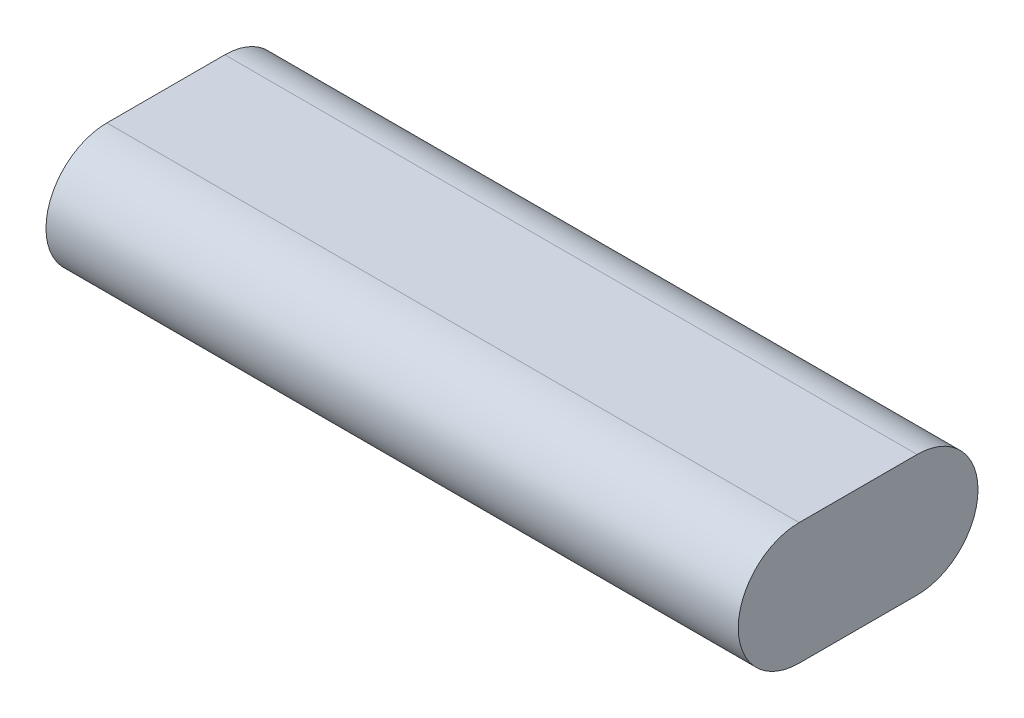
ISO-10303-21;
HEADER;
FILE_DESCRIPTION(('STEP AP214'),'2;1');
FILE_NAME('part.step','',(''),(''),'','','');
FILE_SCHEMA(('AUTOMOTIVE_DESIGN { 1 0 10303 214 1 1 1 1 }'));
ENDSEC;
DATA;
#1=APPLICATION_CONTEXT('core data for automotive mechanical design processes');
#2=APPLICATION_PROTOCOL_DEFINITION('international standard','automotive_design',2000,#1);
#3=PRODUCT_CONTEXT('',#1,'mechanical');
#4=PRODUCT('Part','Part','',(#3));
#5=PRODUCT_RELATED_PRODUCT_CATEGORY('part','',(#4));
#6=PRODUCT_DEFINITION_FORMATION('','',#4);
#7=PRODUCT_DEFINITION_CONTEXT('part definition',#1,'design');
#8=PRODUCT_DEFINITION('design','',#6,#7);
#9=PRODUCT_DEFINITION_SHAPE('','',#8);
#10=(LENGTH_UNIT() NAMED_UNIT(*) SI_UNIT(.MILLI.,.METRE.));
#11=(NAMED_UNIT(*) PLANE_ANGLE_UNIT() SI_UNIT($,.RADIAN.));
#12=(NAMED_UNIT(*) SI_UNIT($,.STERADIAN.) SOLID_ANGLE_UNIT());
#13=UNCERTAINTY_MEASURE_WITH_UNIT(LENGTH_MEASURE(1.E-05),#10,'distance_accuracy_value','');
#14=(GEOMETRIC_REPRESENTATION_CONTEXT(3) GLOBAL_UNCERTAINTY_ASSIGNED_CONTEXT((#13)) GLOBAL_UNIT_ASSIGNED_CONTEXT((#10,
#11,#12)) REPRESENTATION_CONTEXT('',''));
#15=CARTESIAN_POINT('',(0.,0.,0.));
#16=DIRECTION('',(0.,0.,1.));
#17=DIRECTION('',(1.,0.,0.));
#18=AXIS2_PLACEMENT_3D('',#15,#16,#17);
#19=CARTESIAN_POINT('',(68.58,0.,11.684));
#20=DIRECTION('',(-1.,0.,0.));
#21=DIRECTION('',(0.,0.,1.));
#22=AXIS2_PLACEMENT_3D('',#19,#20,#21);
#23=CYLINDRICAL_SURFACE('',#22,12.065);
#24=CARTESIAN_POINT('',(-68.58,0.,11.684));
#25=DIRECTION('',(1.,0.,0.));
#26=DIRECTION('',(0.,0.,-1.));
#27=AXIS2_PLACEMENT_3D('',#24,#25,#26);
#28=CIRCLE('',#27,12.065);
#29=CARTESIAN_POINT('',(-68.58,12.065,11.684));
#30=VERTEX_POINT('',#29);
#31=CARTESIAN_POINT('',(-68.58,-12.065,11.684));
#32=VERTEX_POINT('',#31);
#33=EDGE_CURVE('E96',#30,#32,#28,.T.);
#34=ORIENTED_EDGE('',*,*,#33,.T.);
#35=DIRECTION('',(-1.,0.,0.));
#36=VECTOR('',#35,1.);
#37=CARTESIAN_POINT('',(68.58,-12.065,11.684));
#38=LINE('',#37,#36);
#39=CARTESIAN_POINT('',(68.58,-12.065,11.684));
#40=VERTEX_POINT('',#39);
#41=EDGE_CURVE('E11',#40,#32,#38,.T.);
#42=ORIENTED_EDGE('',*,*,#41,.F.);
#43=CARTESIAN_POINT('',(68.58,0.,11.684));
#44=DIRECTION('',(1.,0.,0.));
#45=DIRECTION('',(0.,0.,-1.));
#46=AXIS2_PLACEMENT_3D('',#43,#44,#45);
#47=CIRCLE('',#46,12.065);
#48=CARTESIAN_POINT('',(68.58,12.065,11.684));
#49=VERTEX_POINT('',#48);
#50=EDGE_CURVE('E84',#49,#40,#47,.T.);
#51=ORIENTED_EDGE('',*,*,#50,.F.);
#52=DIRECTION('',(-1.,0.,0.));
#53=VECTOR('',#52,1.);
#54=CARTESIAN_POINT('',(68.58,12.065,11.684));
#55=LINE('',#54,#53);
#56=EDGE_CURVE('E92',#49,#30,#55,.T.);
#57=ORIENTED_EDGE('',*,*,#56,.T.);
#58=EDGE_LOOP('',(#34,#42,#51,#57));
#59=FACE_BOUND('',#58,.T.);
#60=ADVANCED_FACE('F33',(#59),#23,.T.);
#61=CARTESIAN_POINT('',(68.58,-12.065,11.684));
#62=DIRECTION('',(0.,1.,0.));
#63=DIRECTION('',(0.,0.,1.));
#64=AXIS2_PLACEMENT_3D('',#61,#62,#63);
#65=PLANE('',#64);
#66=DIRECTION('',(0.,0.,-1.));
#67=VECTOR('',#66,1.);
#68=CARTESIAN_POINT('',(-68.58,-12.065,11.684));
#69=LINE('',#68,#67);
#70=CARTESIAN_POINT('',(-68.58,-12.065,-11.684));
#71=VERTEX_POINT('',#70);
#72=EDGE_CURVE('E88',#32,#71,#69,.T.);
#73=ORIENTED_EDGE('',*,*,#72,.T.);
#74=DIRECTION('',(-1.,0.,0.));
#75=VECTOR('',#74,1.);
#76=CARTESIAN_POINT('',(68.58,-12.065,-11.684));
#77=LINE('',#76,#75);
#78=CARTESIAN_POINT('',(68.58,-12.065,-11.684));
#79=VERTEX_POINT('',#78);
#80=EDGE_CURVE('E41',#79,#71,#77,.T.);
#81=ORIENTED_EDGE('',*,*,#80,.F.);
#82=DIRECTION('',(0.,0.,-1.));
#83=VECTOR('',#82,1.);
#84=CARTESIAN_POINT('',(68.58,-12.065,11.684));
#85=LINE('',#84,#83);
#86=EDGE_CURVE('E79',#40,#79,#85,.T.);
#87=ORIENTED_EDGE('',*,*,#86,.F.);
#88=ORIENTED_EDGE('',*,*,#41,.T.);
#89=EDGE_LOOP('',(#73,#81,#87,#88));
#90=FACE_BOUND('',#89,.T.);
#91=ADVANCED_FACE('F87',(#90),#65,.F.);
#92=CARTESIAN_POINT('',(68.58,0.,-11.684));
#93=DIRECTION('',(-1.,0.,0.));
#94=DIRECTION('',(0.,0.,1.));
#95=AXIS2_PLACEMENT_3D('',#92,#93,#94);
#96=CYLINDRICAL_SURFACE('',#95,12.065);
#97=CARTESIAN_POINT('',(-68.58,0.,-11.684));
#98=DIRECTION('',(1.,0.,0.));
#99=DIRECTION('',(0.,0.,-1.));
#100=AXIS2_PLACEMENT_3D('',#97,#98,#99);
#101=CIRCLE('',#100,12.065);
#102=CARTESIAN_POINT('',(-68.58,12.065,-11.684));
#103=VERTEX_POINT('',#102);
#104=EDGE_CURVE('E66',#71,#103,#101,.T.);
#105=ORIENTED_EDGE('',*,*,#104,.T.);
#106=DIRECTION('',(-1.,0.,0.));
#107=VECTOR('',#106,1.);
#108=CARTESIAN_POINT('',(68.58,12.065,-11.684));
#109=LINE('',#108,#107);
#110=CARTESIAN_POINT('',(68.58,12.065,-11.684));
#111=VERTEX_POINT('',#110);
#112=EDGE_CURVE('E89',#111,#103,#109,.T.);
#113=ORIENTED_EDGE('',*,*,#112,.F.);
#114=CARTESIAN_POINT('',(68.58,0.,-11.684));
#115=DIRECTION('',(1.,0.,0.));
#116=DIRECTION('',(0.,0.,-1.));
#117=AXIS2_PLACEMENT_3D('',#114,#115,#116);
#118=CIRCLE('',#117,12.065);
#119=EDGE_CURVE('E82',#79,#111,#118,.T.);
#120=ORIENTED_EDGE('',*,*,#119,.F.);
#121=ORIENTED_EDGE('',*,*,#80,.T.);
#122=EDGE_LOOP('',(#105,#113,#120,#121));
#123=FACE_BOUND('',#122,.T.);
#124=ADVANCED_FACE('F90',(#123),#96,.T.);
#125=CARTESIAN_POINT('',(68.58,12.065,11.684));
#126=DIRECTION('',(0.,-1.,0.));
#127=DIRECTION('',(0.,0.,-1.));
#128=AXIS2_PLACEMENT_3D('',#125,#126,#127);
#129=PLANE('',#128);
#130=DIRECTION('',(0.,0.,1.));
#131=VECTOR('',#130,1.);
#132=CARTESIAN_POINT('',(-68.58,12.065,11.684));
#133=LINE('',#132,#131);
#134=EDGE_CURVE('E72',#103,#30,#133,.T.);
#135=ORIENTED_EDGE('',*,*,#134,.T.);
#136=ORIENTED_EDGE('',*,*,#56,.F.);
#137=DIRECTION('',(0.,0.,1.));
#138=VECTOR('',#137,1.);
#139=CARTESIAN_POINT('',(68.58,12.065,11.684));
#140=LINE('',#139,#138);
#141=EDGE_CURVE('E49',#111,#49,#140,.T.);
#142=ORIENTED_EDGE('',*,*,#141,.F.);
#143=ORIENTED_EDGE('',*,*,#112,.T.);
#144=EDGE_LOOP('',(#135,#136,#142,#143));
#145=FACE_BOUND('',#144,.T.);
#146=ADVANCED_FACE('F103',(#145),#129,.F.);
#147=CARTESIAN_POINT('',(68.58,0.,11.684));
#148=DIRECTION('',(1.,0.,0.));
#149=DIRECTION('',(0.,0.,-1.));
#150=AXIS2_PLACEMENT_3D('',#147,#148,#149);
#151=PLANE('',#150);
#152=ORIENTED_EDGE('',*,*,#50,.T.);
#153=ORIENTED_EDGE('',*,*,#86,.T.);
#154=ORIENTED_EDGE('',*,*,#119,.T.);
#155=ORIENTED_EDGE('',*,*,#141,.T.);
#156=EDGE_LOOP('',(#152,#153,#154,#155));
#157=FACE_BOUND('',#156,.T.);
#158=ADVANCED_FACE('F80',(#157),#151,.T.);
#159=CARTESIAN_POINT('',(-68.58,0.,11.684));
#160=DIRECTION('',(1.,0.,0.));
#161=DIRECTION('',(0.,0.,-1.));
#162=AXIS2_PLACEMENT_3D('',#159,#160,#161);
#163=PLANE('',#162);
#164=ORIENTED_EDGE('',*,*,#33,.F.);
#165=ORIENTED_EDGE('',*,*,#134,.F.);
#166=ORIENTED_EDGE('',*,*,#104,.F.);
#167=ORIENTED_EDGE('',*,*,#72,.F.);
#168=EDGE_LOOP('',(#164,#165,#166,#167));
#169=FACE_BOUND('',#168,.T.);
#170=ADVANCED_FACE('F106',(#169),#163,.F.);
#171=CLOSED_SHELL('',(#60,#91,#124,#146,#158,#170));
#172=MANIFOLD_SOLID_BREP('B2',#171);
#173=ADVANCED_BREP_SHAPE_REPRESENTATION('',(#18,#172),#14);
#174=SHAPE_DEFINITION_REPRESENTATION(#9,#173);
ENDSEC;
END-ISO-10303-21;
